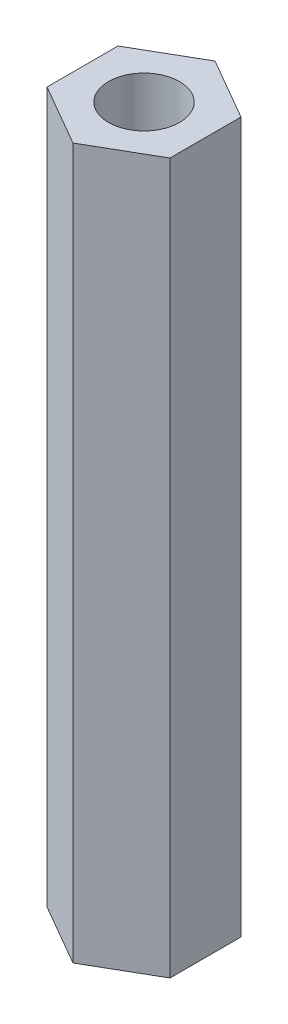
ISO-10303-21;
HEADER;
FILE_DESCRIPTION(('STEP AP214'),'2;1');
FILE_NAME('part.step','',(''),(''),'','','');
FILE_SCHEMA(('AUTOMOTIVE_DESIGN { 1 0 10303 214 1 1 1 1 }'));
ENDSEC;
DATA;
#1=APPLICATION_CONTEXT('core data for automotive mechanical design processes');
#2=APPLICATION_PROTOCOL_DEFINITION('international standard','automotive_design',2000,#1);
#3=PRODUCT_CONTEXT('',#1,'mechanical');
#4=PRODUCT('Part','Part','',(#3));
#5=PRODUCT_RELATED_PRODUCT_CATEGORY('part','',(#4));
#6=PRODUCT_DEFINITION_FORMATION('','',#4);
#7=PRODUCT_DEFINITION_CONTEXT('part definition',#1,'design');
#8=PRODUCT_DEFINITION('design','',#6,#7);
#9=PRODUCT_DEFINITION_SHAPE('','',#8);
#10=(LENGTH_UNIT() NAMED_UNIT(*) SI_UNIT(.MILLI.,.METRE.));
#11=(NAMED_UNIT(*) PLANE_ANGLE_UNIT() SI_UNIT($,.RADIAN.));
#12=(NAMED_UNIT(*) SI_UNIT($,.STERADIAN.) SOLID_ANGLE_UNIT());
#13=UNCERTAINTY_MEASURE_WITH_UNIT(LENGTH_MEASURE(1.E-05),#10,'distance_accuracy_value','');
#14=(GEOMETRIC_REPRESENTATION_CONTEXT(3) GLOBAL_UNCERTAINTY_ASSIGNED_CONTEXT((#13)) GLOBAL_UNIT_ASSIGNED_CONTEXT((#10,
#11,#12)) REPRESENTATION_CONTEXT('',''));
#15=CARTESIAN_POINT('',(0.,0.,0.));
#16=DIRECTION('',(0.,0.,1.));
#17=DIRECTION('',(1.,0.,0.));
#18=AXIS2_PLACEMENT_3D('',#15,#16,#17);
#19=CARTESIAN_POINT('',(0.,50.,-5.));
#20=DIRECTION('',(0.,1.,0.));
#21=DIRECTION('',(0.,0.,1.));
#22=AXIS2_PLACEMENT_3D('',#19,#20,#21);
#23=PLANE('',#22);
#24=DIRECTION('',(-0.866025403784439,0.,-0.5));
#25=VECTOR('',#24,1.);
#26=CARTESIAN_POINT('',(4.33012701892219,50.,-2.5));
#27=LINE('',#26,#25);
#28=CARTESIAN_POINT('',(4.33012701892219,50.,-2.5));
#29=VERTEX_POINT('',#28);
#30=CARTESIAN_POINT('',(0.,50.,-5.));
#31=VERTEX_POINT('',#30);
#32=EDGE_CURVE('E126',#29,#31,#27,.T.);
#33=ORIENTED_EDGE('',*,*,#32,.T.);
#34=DIRECTION('',(-0.866025403784439,0.,0.5));
#35=VECTOR('',#34,1.);
#36=CARTESIAN_POINT('',(0.,50.,-5.));
#37=LINE('',#36,#35);
#38=CARTESIAN_POINT('',(-4.33012701892219,50.,-2.5));
#39=VERTEX_POINT('',#38);
#40=EDGE_CURVE('E84',#31,#39,#37,.T.);
#41=ORIENTED_EDGE('',*,*,#40,.T.);
#42=DIRECTION('',(0.,0.,1.));
#43=VECTOR('',#42,1.);
#44=CARTESIAN_POINT('',(-4.33012701892219,50.,-2.5));
#45=LINE('',#44,#43);
#46=CARTESIAN_POINT('',(-4.33012701892219,50.,2.5));
#47=VERTEX_POINT('',#46);
#48=EDGE_CURVE('E97',#39,#47,#45,.T.);
#49=ORIENTED_EDGE('',*,*,#48,.T.);
#50=DIRECTION('',(0.866025403784439,0.,0.5));
#51=VECTOR('',#50,1.);
#52=CARTESIAN_POINT('',(-4.33012701892219,50.,2.5));
#53=LINE('',#52,#51);
#54=CARTESIAN_POINT('',(0.,50.,5.));
#55=VERTEX_POINT('',#54);
#56=EDGE_CURVE('E91',#47,#55,#53,.T.);
#57=ORIENTED_EDGE('',*,*,#56,.T.);
#58=DIRECTION('',(0.866025403784439,0.,-0.5));
#59=VECTOR('',#58,1.);
#60=CARTESIAN_POINT('',(0.,50.,5.));
#61=LINE('',#60,#59);
#62=CARTESIAN_POINT('',(4.33012701892219,50.,2.5));
#63=VERTEX_POINT('',#62);
#64=EDGE_CURVE('E95',#55,#63,#61,.T.);
#65=ORIENTED_EDGE('',*,*,#64,.T.);
#66=DIRECTION('',(0.,0.,-1.));
#67=VECTOR('',#66,1.);
#68=CARTESIAN_POINT('',(4.33012701892219,50.,2.5));
#69=LINE('',#68,#67);
#70=EDGE_CURVE('E47',#63,#29,#69,.T.);
#71=ORIENTED_EDGE('',*,*,#70,.T.);
#72=EDGE_LOOP('',(#33,#41,#49,#57,#65,#71));
#73=FACE_BOUND('',#72,.T.);
#74=CARTESIAN_POINT('',(0.,50.,0.));
#75=DIRECTION('',(0.,1.,0.));
#76=DIRECTION('',(0.,0.,1.));
#77=AXIS2_PLACEMENT_3D('',#74,#75,#76);
#78=CIRCLE('',#77,2.5);
#79=CARTESIAN_POINT('',(0.,50.,2.5));
#80=VERTEX_POINT('',#79);
#81=EDGE_CURVE('E119',#80,#80,#78,.T.);
#82=ORIENTED_EDGE('',*,*,#81,.F.);
#83=EDGE_LOOP('',(#82));
#84=FACE_BOUND('',#83,.T.);
#85=ADVANCED_FACE('F30',(#73,#84),#23,.T.);
#86=CARTESIAN_POINT('',(0.,0.,-5.));
#87=DIRECTION('',(0.,1.,0.));
#88=DIRECTION('',(0.,0.,1.));
#89=AXIS2_PLACEMENT_3D('',#86,#87,#88);
#90=PLANE('',#89);
#91=DIRECTION('',(-0.866025403784439,0.,-0.5));
#92=VECTOR('',#91,1.);
#93=CARTESIAN_POINT('',(4.33012701892219,0.,-2.5));
#94=LINE('',#93,#92);
#95=CARTESIAN_POINT('',(4.33012701892219,0.,-2.5));
#96=VERTEX_POINT('',#95);
#97=CARTESIAN_POINT('',(0.,0.,-5.));
#98=VERTEX_POINT('',#97);
#99=EDGE_CURVE('E115',#96,#98,#94,.T.);
#100=ORIENTED_EDGE('',*,*,#99,.F.);
#101=DIRECTION('',(0.,0.,-1.));
#102=VECTOR('',#101,1.);
#103=CARTESIAN_POINT('',(4.33012701892219,0.,2.5));
#104=LINE('',#103,#102);
#105=CARTESIAN_POINT('',(4.33012701892219,0.,2.5));
#106=VERTEX_POINT('',#105);
#107=EDGE_CURVE('E76',#106,#96,#104,.T.);
#108=ORIENTED_EDGE('',*,*,#107,.F.);
#109=DIRECTION('',(0.866025403784439,0.,-0.5));
#110=VECTOR('',#109,1.);
#111=CARTESIAN_POINT('',(0.,0.,5.));
#112=LINE('',#111,#110);
#113=CARTESIAN_POINT('',(0.,0.,5.));
#114=VERTEX_POINT('',#113);
#115=EDGE_CURVE('E70',#114,#106,#112,.T.);
#116=ORIENTED_EDGE('',*,*,#115,.F.);
#117=DIRECTION('',(0.866025403784439,0.,0.5));
#118=VECTOR('',#117,1.);
#119=CARTESIAN_POINT('',(-4.33012701892219,0.,2.5));
#120=LINE('',#119,#118);
#121=CARTESIAN_POINT('',(-4.33012701892219,0.,2.5));
#122=VERTEX_POINT('',#121);
#123=EDGE_CURVE('E105',#122,#114,#120,.T.);
#124=ORIENTED_EDGE('',*,*,#123,.F.);
#125=DIRECTION('',(0.,0.,1.));
#126=VECTOR('',#125,1.);
#127=CARTESIAN_POINT('',(-4.33012701892219,0.,-2.5));
#128=LINE('',#127,#126);
#129=CARTESIAN_POINT('',(-4.33012701892219,0.,-2.5));
#130=VERTEX_POINT('',#129);
#131=EDGE_CURVE('E121',#130,#122,#128,.T.);
#132=ORIENTED_EDGE('',*,*,#131,.F.);
#133=DIRECTION('',(-0.866025403784439,0.,0.5));
#134=VECTOR('',#133,1.);
#135=CARTESIAN_POINT('',(0.,0.,-5.));
#136=LINE('',#135,#134);
#137=EDGE_CURVE('E118',#98,#130,#136,.T.);
#138=ORIENTED_EDGE('',*,*,#137,.F.);
#139=EDGE_LOOP('',(#100,#108,#116,#124,#132,#138));
#140=FACE_BOUND('',#139,.T.);
#141=CARTESIAN_POINT('',(0.,0.,0.));
#142=DIRECTION('',(0.,1.,0.));
#143=DIRECTION('',(0.,0.,1.));
#144=AXIS2_PLACEMENT_3D('',#141,#142,#143);
#145=CIRCLE('',#144,2.5);
#146=CARTESIAN_POINT('',(0.,0.,2.5));
#147=VERTEX_POINT('',#146);
#148=EDGE_CURVE('E219',#147,#147,#145,.T.);
#149=ORIENTED_EDGE('',*,*,#148,.T.);
#150=EDGE_LOOP('',(#149));
#151=FACE_BOUND('',#150,.T.);
#152=ADVANCED_FACE('F135',(#140,#151),#90,.F.);
#153=CARTESIAN_POINT('',(4.33012701892219,50.,-2.5));
#154=DIRECTION('',(-0.5,0.,0.866025403784439));
#155=DIRECTION('',(0.866025403784439,0.,0.5));
#156=AXIS2_PLACEMENT_3D('',#153,#154,#155);
#157=PLANE('',#156);
#158=ORIENTED_EDGE('',*,*,#99,.T.);
#159=DIRECTION('',(0.,-1.,0.));
#160=VECTOR('',#159,1.);
#161=CARTESIAN_POINT('',(0.,50.,-5.));
#162=LINE('',#161,#160);
#163=EDGE_CURVE('E11',#31,#98,#162,.T.);
#164=ORIENTED_EDGE('',*,*,#163,.F.);
#165=ORIENTED_EDGE('',*,*,#32,.F.);
#166=DIRECTION('',(0.,-1.,0.));
#167=VECTOR('',#166,1.);
#168=CARTESIAN_POINT('',(4.33012701892219,50.,-2.5));
#169=LINE('',#168,#167);
#170=EDGE_CURVE('E111',#29,#96,#169,.T.);
#171=ORIENTED_EDGE('',*,*,#170,.T.);
#172=EDGE_LOOP('',(#158,#164,#165,#171));
#173=FACE_BOUND('',#172,.T.);
#174=ADVANCED_FACE('F32',(#173),#157,.F.);
#175=CARTESIAN_POINT('',(0.,50.,-5.));
#176=DIRECTION('',(0.5,0.,0.866025403784439));
#177=DIRECTION('',(0.866025403784439,0.,-0.5));
#178=AXIS2_PLACEMENT_3D('',#175,#176,#177);
#179=PLANE('',#178);
#180=ORIENTED_EDGE('',*,*,#137,.T.);
#181=DIRECTION('',(0.,-1.,0.));
#182=VECTOR('',#181,1.);
#183=CARTESIAN_POINT('',(-4.33012701892219,50.,-2.5));
#184=LINE('',#183,#182);
#185=EDGE_CURVE('E39',#39,#130,#184,.T.);
#186=ORIENTED_EDGE('',*,*,#185,.F.);
#187=ORIENTED_EDGE('',*,*,#40,.F.);
#188=ORIENTED_EDGE('',*,*,#163,.T.);
#189=EDGE_LOOP('',(#180,#186,#187,#188));
#190=FACE_BOUND('',#189,.T.);
#191=ADVANCED_FACE('F160',(#190),#179,.F.);
#192=CARTESIAN_POINT('',(-4.33012701892219,50.,-2.5));
#193=DIRECTION('',(1.,0.,0.));
#194=DIRECTION('',(0.,0.,-1.));
#195=AXIS2_PLACEMENT_3D('',#192,#193,#194);
#196=PLANE('',#195);
#197=ORIENTED_EDGE('',*,*,#131,.T.);
#198=DIRECTION('',(0.,-1.,0.));
#199=VECTOR('',#198,1.);
#200=CARTESIAN_POINT('',(-4.33012701892219,50.,2.5));
#201=LINE('',#200,#199);
#202=EDGE_CURVE('E106',#47,#122,#201,.T.);
#203=ORIENTED_EDGE('',*,*,#202,.F.);
#204=ORIENTED_EDGE('',*,*,#48,.F.);
#205=ORIENTED_EDGE('',*,*,#185,.T.);
#206=EDGE_LOOP('',(#197,#203,#204,#205));
#207=FACE_BOUND('',#206,.T.);
#208=ADVANCED_FACE('F132',(#207),#196,.F.);
#209=CARTESIAN_POINT('',(-4.33012701892219,50.,2.5));
#210=DIRECTION('',(0.5,0.,-0.866025403784439));
#211=DIRECTION('',(-0.866025403784439,0.,-0.5));
#212=AXIS2_PLACEMENT_3D('',#209,#210,#211);
#213=PLANE('',#212);
#214=ORIENTED_EDGE('',*,*,#123,.T.);
#215=DIRECTION('',(0.,-1.,0.));
#216=VECTOR('',#215,1.);
#217=CARTESIAN_POINT('',(0.,50.,5.));
#218=LINE('',#217,#216);
#219=EDGE_CURVE('E102',#55,#114,#218,.T.);
#220=ORIENTED_EDGE('',*,*,#219,.F.);
#221=ORIENTED_EDGE('',*,*,#56,.F.);
#222=ORIENTED_EDGE('',*,*,#202,.T.);
#223=EDGE_LOOP('',(#214,#220,#221,#222));
#224=FACE_BOUND('',#223,.T.);
#225=ADVANCED_FACE('F103',(#224),#213,.F.);
#226=CARTESIAN_POINT('',(0.,50.,5.));
#227=DIRECTION('',(-0.5,0.,-0.866025403784439));
#228=DIRECTION('',(-0.866025403784439,0.,0.5));
#229=AXIS2_PLACEMENT_3D('',#226,#227,#228);
#230=PLANE('',#229);
#231=ORIENTED_EDGE('',*,*,#115,.T.);
#232=DIRECTION('',(0.,-1.,0.));
#233=VECTOR('',#232,1.);
#234=CARTESIAN_POINT('',(4.33012701892219,50.,2.5));
#235=LINE('',#234,#233);
#236=EDGE_CURVE('E107',#63,#106,#235,.T.);
#237=ORIENTED_EDGE('',*,*,#236,.F.);
#238=ORIENTED_EDGE('',*,*,#64,.F.);
#239=ORIENTED_EDGE('',*,*,#219,.T.);
#240=EDGE_LOOP('',(#231,#237,#238,#239));
#241=FACE_BOUND('',#240,.T.);
#242=ADVANCED_FACE('F109',(#241),#230,.F.);
#243=CARTESIAN_POINT('',(4.33012701892219,50.,2.5));
#244=DIRECTION('',(-1.,0.,0.));
#245=DIRECTION('',(0.,0.,1.));
#246=AXIS2_PLACEMENT_3D('',#243,#244,#245);
#247=PLANE('',#246);
#248=ORIENTED_EDGE('',*,*,#107,.T.);
#249=ORIENTED_EDGE('',*,*,#170,.F.);
#250=ORIENTED_EDGE('',*,*,#70,.F.);
#251=ORIENTED_EDGE('',*,*,#236,.T.);
#252=EDGE_LOOP('',(#248,#249,#250,#251));
#253=FACE_BOUND('',#252,.T.);
#254=ADVANCED_FACE('F140',(#253),#247,.F.);
#255=CARTESIAN_POINT('',(0.,50.,0.));
#256=DIRECTION('',(0.,-1.,0.));
#257=DIRECTION('',(0.,0.,-1.));
#258=AXIS2_PLACEMENT_3D('',#255,#256,#257);
#259=CYLINDRICAL_SURFACE('',#258,2.5);
#260=ORIENTED_EDGE('',*,*,#81,.T.);
#261=EDGE_LOOP('',(#260));
#262=FACE_BOUND('',#261,.T.);
#263=ORIENTED_EDGE('',*,*,#148,.F.);
#264=EDGE_LOOP('',(#263));
#265=FACE_BOUND('',#264,.T.);
#266=ADVANCED_FACE('F142',(#262,#265),#259,.F.);
#267=CLOSED_SHELL('',(#85,#152,#174,#191,#208,#225,#242,#254,#266));
#268=MANIFOLD_SOLID_BREP('B2',#267);
#269=ADVANCED_BREP_SHAPE_REPRESENTATION('',(#18,#268),#14);
#270=SHAPE_DEFINITION_REPRESENTATION(#9,#269);
ENDSEC;
END-ISO-10303-21;
